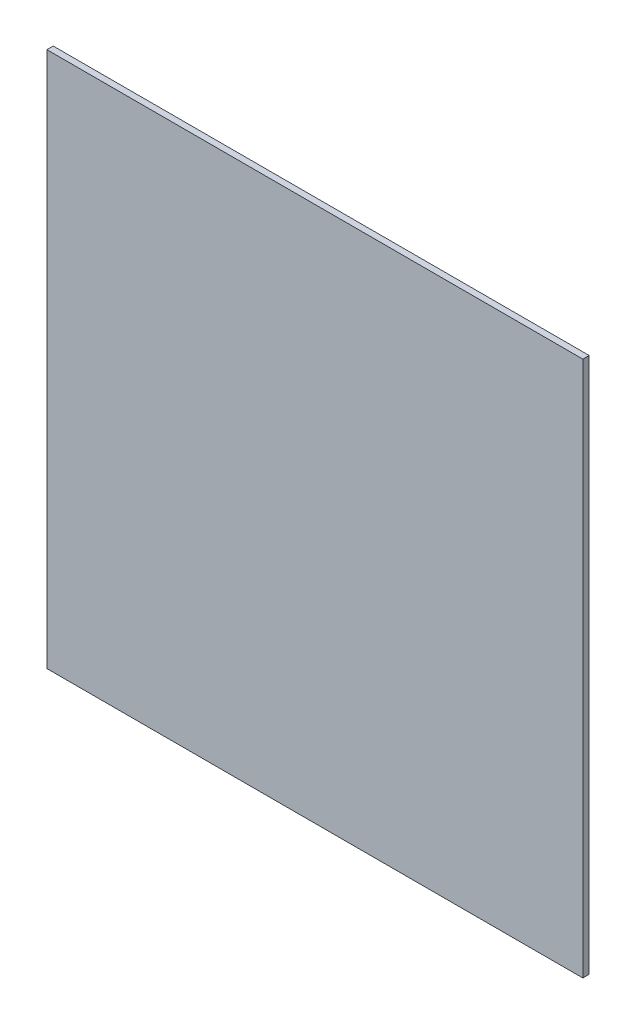
ISO-10303-21;
HEADER;
FILE_DESCRIPTION(('STEP AP214'),'2;1');
FILE_NAME('part.step','',(''),(''),'','','');
FILE_SCHEMA(('AUTOMOTIVE_DESIGN { 1 0 10303 214 1 1 1 1 }'));
ENDSEC;
DATA;
#1=APPLICATION_CONTEXT('core data for automotive mechanical design processes');
#2=APPLICATION_PROTOCOL_DEFINITION('international standard','automotive_design',2000,#1);
#3=PRODUCT_CONTEXT('',#1,'mechanical');
#4=PRODUCT('Part','Part','',(#3));
#5=PRODUCT_RELATED_PRODUCT_CATEGORY('part','',(#4));
#6=PRODUCT_DEFINITION_FORMATION('','',#4);
#7=PRODUCT_DEFINITION_CONTEXT('part definition',#1,'design');
#8=PRODUCT_DEFINITION('design','',#6,#7);
#9=PRODUCT_DEFINITION_SHAPE('','',#8);
#10=(LENGTH_UNIT() NAMED_UNIT(*) SI_UNIT(.MILLI.,.METRE.));
#11=(NAMED_UNIT(*) PLANE_ANGLE_UNIT() SI_UNIT($,.RADIAN.));
#12=(NAMED_UNIT(*) SI_UNIT($,.STERADIAN.) SOLID_ANGLE_UNIT());
#13=UNCERTAINTY_MEASURE_WITH_UNIT(LENGTH_MEASURE(1.E-05),#10,'distance_accuracy_value','');
#14=(GEOMETRIC_REPRESENTATION_CONTEXT(3) GLOBAL_UNCERTAINTY_ASSIGNED_CONTEXT((#13)) GLOBAL_UNIT_ASSIGNED_CONTEXT((#10,
#11,#12)) REPRESENTATION_CONTEXT('',''));
#15=CARTESIAN_POINT('',(0.,0.,0.));
#16=DIRECTION('',(0.,0.,1.));
#17=DIRECTION('',(1.,0.,0.));
#18=AXIS2_PLACEMENT_3D('',#15,#16,#17);
#19=CARTESIAN_POINT('',(127.,-127.,0.));
#20=DIRECTION('',(1.,0.,0.));
#21=DIRECTION('',(0.,1.,0.));
#22=AXIS2_PLACEMENT_3D('',#19,#20,#21);
#23=PLANE('',#22);
#24=DIRECTION('',(0.,1.,0.));
#25=VECTOR('',#24,1.);
#26=CARTESIAN_POINT('',(127.,-127.,3.));
#27=LINE('',#26,#25);
#28=CARTESIAN_POINT('',(127.,-127.,3.));
#29=VERTEX_POINT('',#28);
#30=CARTESIAN_POINT('',(127.,127.,3.));
#31=VERTEX_POINT('',#30);
#32=EDGE_CURVE('E97',#29,#31,#27,.T.);
#33=ORIENTED_EDGE('',*,*,#32,.F.);
#34=DIRECTION('',(0.,0.,1.));
#35=VECTOR('',#34,1.);
#36=CARTESIAN_POINT('',(127.,-127.,0.));
#37=LINE('',#36,#35);
#38=CARTESIAN_POINT('',(127.,-127.,0.));
#39=VERTEX_POINT('',#38);
#40=EDGE_CURVE('E11',#39,#29,#37,.T.);
#41=ORIENTED_EDGE('',*,*,#40,.F.);
#42=DIRECTION('',(0.,1.,0.));
#43=VECTOR('',#42,1.);
#44=CARTESIAN_POINT('',(127.,-127.,0.));
#45=LINE('',#44,#43);
#46=CARTESIAN_POINT('',(127.,127.,0.));
#47=VERTEX_POINT('',#46);
#48=EDGE_CURVE('E91',#39,#47,#45,.T.);
#49=ORIENTED_EDGE('',*,*,#48,.T.);
#50=DIRECTION('',(0.,0.,1.));
#51=VECTOR('',#50,1.);
#52=CARTESIAN_POINT('',(127.,127.,0.));
#53=LINE('',#52,#51);
#54=EDGE_CURVE('E36',#47,#31,#53,.T.);
#55=ORIENTED_EDGE('',*,*,#54,.T.);
#56=EDGE_LOOP('',(#33,#41,#49,#55));
#57=FACE_BOUND('',#56,.T.);
#58=ADVANCED_FACE('F33',(#57),#23,.T.);
#59=CARTESIAN_POINT('',(-127.,-127.,0.));
#60=DIRECTION('',(0.,-1.,0.));
#61=DIRECTION('',(1.,0.,0.));
#62=AXIS2_PLACEMENT_3D('',#59,#60,#61);
#63=PLANE('',#62);
#64=DIRECTION('',(1.,0.,0.));
#65=VECTOR('',#64,1.);
#66=CARTESIAN_POINT('',(-127.,-127.,3.));
#67=LINE('',#66,#65);
#68=CARTESIAN_POINT('',(-127.,-127.,3.));
#69=VERTEX_POINT('',#68);
#70=EDGE_CURVE('E93',#69,#29,#67,.T.);
#71=ORIENTED_EDGE('',*,*,#70,.F.);
#72=DIRECTION('',(0.,0.,1.));
#73=VECTOR('',#72,1.);
#74=CARTESIAN_POINT('',(-127.,-127.,0.));
#75=LINE('',#74,#73);
#76=CARTESIAN_POINT('',(-127.,-127.,0.));
#77=VERTEX_POINT('',#76);
#78=EDGE_CURVE('E42',#77,#69,#75,.T.);
#79=ORIENTED_EDGE('',*,*,#78,.F.);
#80=DIRECTION('',(1.,0.,0.));
#81=VECTOR('',#80,1.);
#82=CARTESIAN_POINT('',(-127.,-127.,0.));
#83=LINE('',#82,#81);
#84=EDGE_CURVE('E88',#77,#39,#83,.T.);
#85=ORIENTED_EDGE('',*,*,#84,.T.);
#86=ORIENTED_EDGE('',*,*,#40,.T.);
#87=EDGE_LOOP('',(#71,#79,#85,#86));
#88=FACE_BOUND('',#87,.T.);
#89=ADVANCED_FACE('F107',(#88),#63,.T.);
#90=CARTESIAN_POINT('',(-127.,127.,0.));
#91=DIRECTION('',(-1.,0.,0.));
#92=DIRECTION('',(0.,-1.,0.));
#93=AXIS2_PLACEMENT_3D('',#90,#91,#92);
#94=PLANE('',#93);
#95=DIRECTION('',(0.,-1.,0.));
#96=VECTOR('',#95,1.);
#97=CARTESIAN_POINT('',(-127.,127.,3.));
#98=LINE('',#97,#96);
#99=CARTESIAN_POINT('',(-127.,127.,3.));
#100=VERTEX_POINT('',#99);
#101=EDGE_CURVE('E83',#100,#69,#98,.T.);
#102=ORIENTED_EDGE('',*,*,#101,.F.);
#103=DIRECTION('',(0.,0.,1.));
#104=VECTOR('',#103,1.);
#105=CARTESIAN_POINT('',(-127.,127.,0.));
#106=LINE('',#105,#104);
#107=CARTESIAN_POINT('',(-127.,127.,0.));
#108=VERTEX_POINT('',#107);
#109=EDGE_CURVE('E78',#108,#100,#106,.T.);
#110=ORIENTED_EDGE('',*,*,#109,.F.);
#111=DIRECTION('',(0.,-1.,0.));
#112=VECTOR('',#111,1.);
#113=CARTESIAN_POINT('',(-127.,127.,0.));
#114=LINE('',#113,#112);
#115=EDGE_CURVE('E81',#108,#77,#114,.T.);
#116=ORIENTED_EDGE('',*,*,#115,.T.);
#117=ORIENTED_EDGE('',*,*,#78,.T.);
#118=EDGE_LOOP('',(#102,#110,#116,#117));
#119=FACE_BOUND('',#118,.T.);
#120=ADVANCED_FACE('F80',(#119),#94,.T.);
#121=CARTESIAN_POINT('',(127.,127.,0.));
#122=DIRECTION('',(0.,1.,0.));
#123=DIRECTION('',(-1.,0.,0.));
#124=AXIS2_PLACEMENT_3D('',#121,#122,#123);
#125=PLANE('',#124);
#126=DIRECTION('',(-1.,0.,0.));
#127=VECTOR('',#126,1.);
#128=CARTESIAN_POINT('',(127.,127.,3.));
#129=LINE('',#128,#127);
#130=EDGE_CURVE('E100',#31,#100,#129,.T.);
#131=ORIENTED_EDGE('',*,*,#130,.F.);
#132=ORIENTED_EDGE('',*,*,#54,.F.);
#133=DIRECTION('',(-1.,0.,0.));
#134=VECTOR('',#133,1.);
#135=CARTESIAN_POINT('',(127.,127.,0.));
#136=LINE('',#135,#134);
#137=EDGE_CURVE('E87',#47,#108,#136,.T.);
#138=ORIENTED_EDGE('',*,*,#137,.T.);
#139=ORIENTED_EDGE('',*,*,#109,.T.);
#140=EDGE_LOOP('',(#131,#132,#138,#139));
#141=FACE_BOUND('',#140,.T.);
#142=ADVANCED_FACE('F90',(#141),#125,.T.);
#143=CARTESIAN_POINT('',(0.,0.,0.));
#144=DIRECTION('',(0.,0.,1.));
#145=DIRECTION('',(1.,0.,0.));
#146=AXIS2_PLACEMENT_3D('',#143,#144,#145);
#147=PLANE('',#146);
#148=ORIENTED_EDGE('',*,*,#48,.F.);
#149=ORIENTED_EDGE('',*,*,#84,.F.);
#150=ORIENTED_EDGE('',*,*,#115,.F.);
#151=ORIENTED_EDGE('',*,*,#137,.F.);
#152=EDGE_LOOP('',(#148,#149,#150,#151));
#153=FACE_BOUND('',#152,.T.);
#154=ADVANCED_FACE('F86',(#153),#147,.F.);
#155=CARTESIAN_POINT('',(0.,0.,3.));
#156=DIRECTION('',(0.,0.,1.));
#157=DIRECTION('',(1.,0.,0.));
#158=AXIS2_PLACEMENT_3D('',#155,#156,#157);
#159=PLANE('',#158);
#160=ORIENTED_EDGE('',*,*,#32,.T.);
#161=ORIENTED_EDGE('',*,*,#130,.T.);
#162=ORIENTED_EDGE('',*,*,#101,.T.);
#163=ORIENTED_EDGE('',*,*,#70,.T.);
#164=EDGE_LOOP('',(#160,#161,#162,#163));
#165=FACE_BOUND('',#164,.T.);
#166=ADVANCED_FACE('F106',(#165),#159,.T.);
#167=CLOSED_SHELL('',(#58,#89,#120,#142,#154,#166));
#168=MANIFOLD_SOLID_BREP('B2',#167);
#169=ADVANCED_BREP_SHAPE_REPRESENTATION('',(#18,#168),#14);
#170=SHAPE_DEFINITION_REPRESENTATION(#9,#169);
ENDSEC;
END-ISO-10303-21;
